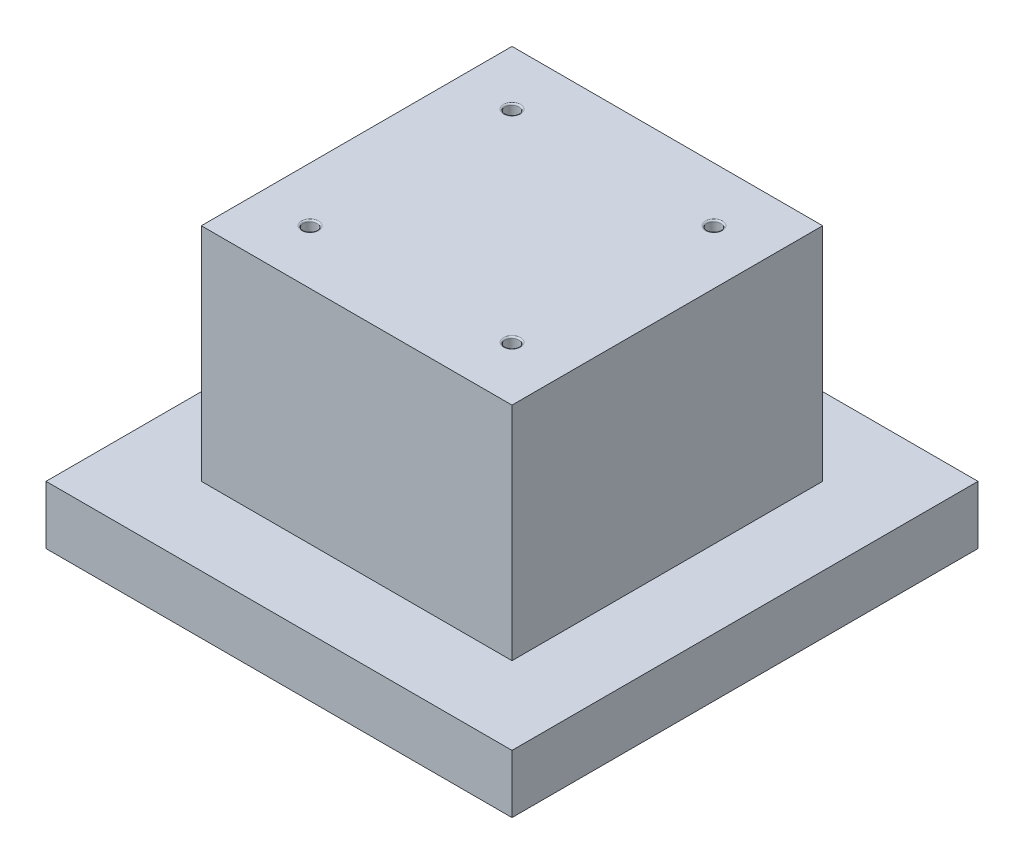
ISO-10303-21;
HEADER;
FILE_DESCRIPTION(('STEP AP214'),'2;1');
FILE_NAME('part.step','',(''),(''),'','','');
FILE_SCHEMA(('AUTOMOTIVE_DESIGN { 1 0 10303 214 1 1 1 1 }'));
ENDSEC;
DATA;
#1=APPLICATION_CONTEXT('core data for automotive mechanical design processes');
#2=APPLICATION_PROTOCOL_DEFINITION('international standard','automotive_design',2000,#1);
#3=PRODUCT_CONTEXT('',#1,'mechanical');
#4=PRODUCT('Part','Part','',(#3));
#5=PRODUCT_RELATED_PRODUCT_CATEGORY('part','',(#4));
#6=PRODUCT_DEFINITION_FORMATION('','',#4);
#7=PRODUCT_DEFINITION_CONTEXT('part definition',#1,'design');
#8=PRODUCT_DEFINITION('design','',#6,#7);
#9=PRODUCT_DEFINITION_SHAPE('','',#8);
#10=(LENGTH_UNIT() NAMED_UNIT(*) SI_UNIT(.MILLI.,.METRE.));
#11=(NAMED_UNIT(*) PLANE_ANGLE_UNIT() SI_UNIT($,.RADIAN.));
#12=(NAMED_UNIT(*) SI_UNIT($,.STERADIAN.) SOLID_ANGLE_UNIT());
#13=UNCERTAINTY_MEASURE_WITH_UNIT(LENGTH_MEASURE(1.E-05),#10,'distance_accuracy_value','');
#14=(GEOMETRIC_REPRESENTATION_CONTEXT(3) GLOBAL_UNCERTAINTY_ASSIGNED_CONTEXT((#13)) GLOBAL_UNIT_ASSIGNED_CONTEXT((#10,
#11,#12)) REPRESENTATION_CONTEXT('',''));
#15=CARTESIAN_POINT('',(0.,0.,0.));
#16=DIRECTION('',(0.,0.,1.));
#17=DIRECTION('',(1.,0.,0.));
#18=AXIS2_PLACEMENT_3D('',#15,#16,#17);
#19=CARTESIAN_POINT('',(38.1,9.525,38.1));
#20=DIRECTION('',(0.,1.,0.));
#21=DIRECTION('',(0.,0.,1.));
#22=AXIS2_PLACEMENT_3D('',#19,#20,#21);
#23=PLANE('',#22);
#24=DIRECTION('',(0.,0.,-1.));
#25=VECTOR('',#24,1.);
#26=CARTESIAN_POINT('',(38.1,9.525,-38.1));
#27=LINE('',#26,#25);
#28=CARTESIAN_POINT('',(38.1,9.525,38.1));
#29=VERTEX_POINT('',#28);
#30=CARTESIAN_POINT('',(38.1,9.525,-38.1));
#31=VERTEX_POINT('',#30);
#32=EDGE_CURVE('E220',#29,#31,#27,.T.);
#33=ORIENTED_EDGE('',*,*,#32,.T.);
#34=DIRECTION('',(-1.,0.,0.));
#35=VECTOR('',#34,1.);
#36=CARTESIAN_POINT('',(-38.1,9.525,-38.1));
#37=LINE('',#36,#35);
#38=CARTESIAN_POINT('',(-38.1,9.525,-38.1));
#39=VERTEX_POINT('',#38);
#40=EDGE_CURVE('E223',#31,#39,#37,.T.);
#41=ORIENTED_EDGE('',*,*,#40,.T.);
#42=DIRECTION('',(0.,0.,1.));
#43=VECTOR('',#42,1.);
#44=CARTESIAN_POINT('',(-38.1,9.525,-38.1));
#45=LINE('',#44,#43);
#46=CARTESIAN_POINT('',(-38.1,9.525,38.1));
#47=VERTEX_POINT('',#46);
#48=EDGE_CURVE('E226',#39,#47,#45,.T.);
#49=ORIENTED_EDGE('',*,*,#48,.T.);
#50=DIRECTION('',(1.,0.,0.));
#51=VECTOR('',#50,1.);
#52=CARTESIAN_POINT('',(-38.1,9.525,38.1));
#53=LINE('',#52,#51);
#54=EDGE_CURVE('E228',#47,#29,#53,.T.);
#55=ORIENTED_EDGE('',*,*,#54,.T.);
#56=EDGE_LOOP('',(#33,#41,#49,#55));
#57=FACE_BOUND('',#56,.T.);
#58=DIRECTION('',(-1.,0.,0.));
#59=VECTOR('',#58,1.);
#60=CARTESIAN_POINT('',(-25.4,9.525,-25.4));
#61=LINE('',#60,#59);
#62=CARTESIAN_POINT('',(25.4,9.525,-25.4));
#63=VERTEX_POINT('',#62);
#64=CARTESIAN_POINT('',(-25.4,9.525,-25.4));
#65=VERTEX_POINT('',#64);
#66=EDGE_CURVE('E176',#63,#65,#61,.T.);
#67=ORIENTED_EDGE('',*,*,#66,.F.);
#68=DIRECTION('',(0.,0.,-1.));
#69=VECTOR('',#68,1.);
#70=CARTESIAN_POINT('',(25.4,9.525,-25.4));
#71=LINE('',#70,#69);
#72=CARTESIAN_POINT('',(25.4,9.525,25.4));
#73=VERTEX_POINT('',#72);
#74=EDGE_CURVE('E162',#73,#63,#71,.T.);
#75=ORIENTED_EDGE('',*,*,#74,.F.);
#76=DIRECTION('',(1.,0.,0.));
#77=VECTOR('',#76,1.);
#78=CARTESIAN_POINT('',(-25.4,9.525,25.4));
#79=LINE('',#78,#77);
#80=CARTESIAN_POINT('',(-25.4,9.525,25.4));
#81=VERTEX_POINT('',#80);
#82=EDGE_CURVE('E167',#81,#73,#79,.T.);
#83=ORIENTED_EDGE('',*,*,#82,.F.);
#84=DIRECTION('',(0.,0.,1.));
#85=VECTOR('',#84,1.);
#86=CARTESIAN_POINT('',(-25.4,9.525,-25.4));
#87=LINE('',#86,#85);
#88=EDGE_CURVE('E178',#65,#81,#87,.T.);
#89=ORIENTED_EDGE('',*,*,#88,.F.);
#90=EDGE_LOOP('',(#67,#75,#83,#89));
#91=FACE_BOUND('',#90,.T.);
#92=ADVANCED_FACE('F41',(#57,#91),#23,.T.);
#93=CARTESIAN_POINT('',(38.1,9.525,-38.1));
#94=DIRECTION('',(-1.,0.,0.));
#95=DIRECTION('',(0.,0.,1.));
#96=AXIS2_PLACEMENT_3D('',#93,#94,#95);
#97=PLANE('',#96);
#98=DIRECTION('',(0.,0.,-1.));
#99=VECTOR('',#98,1.);
#100=CARTESIAN_POINT('',(38.1,0.,-38.1));
#101=LINE('',#100,#99);
#102=CARTESIAN_POINT('',(38.1,0.,38.1));
#103=VERTEX_POINT('',#102);
#104=CARTESIAN_POINT('',(38.1,0.,-38.1));
#105=VERTEX_POINT('',#104);
#106=EDGE_CURVE('E214',#103,#105,#101,.T.);
#107=ORIENTED_EDGE('',*,*,#106,.T.);
#108=DIRECTION('',(0.,-1.,0.));
#109=VECTOR('',#108,1.);
#110=CARTESIAN_POINT('',(38.1,9.525,-38.1));
#111=LINE('',#110,#109);
#112=EDGE_CURVE('E246',#31,#105,#111,.T.);
#113=ORIENTED_EDGE('',*,*,#112,.F.);
#114=ORIENTED_EDGE('',*,*,#32,.F.);
#115=DIRECTION('',(0.,-1.,0.));
#116=VECTOR('',#115,1.);
#117=CARTESIAN_POINT('',(38.1,9.525,38.1));
#118=LINE('',#117,#116);
#119=EDGE_CURVE('E230',#29,#103,#118,.T.);
#120=ORIENTED_EDGE('',*,*,#119,.T.);
#121=EDGE_LOOP('',(#107,#113,#114,#120));
#122=FACE_BOUND('',#121,.T.);
#123=ADVANCED_FACE('F284',(#122),#97,.F.);
#124=CARTESIAN_POINT('',(-38.1,9.525,-38.1));
#125=DIRECTION('',(0.,0.,1.));
#126=DIRECTION('',(1.,0.,0.));
#127=AXIS2_PLACEMENT_3D('',#124,#125,#126);
#128=PLANE('',#127);
#129=DIRECTION('',(-1.,0.,0.));
#130=VECTOR('',#129,1.);
#131=CARTESIAN_POINT('',(-38.1,0.,-38.1));
#132=LINE('',#131,#130);
#133=CARTESIAN_POINT('',(-38.1,0.,-38.1));
#134=VERTEX_POINT('',#133);
#135=EDGE_CURVE('E233',#105,#134,#132,.T.);
#136=ORIENTED_EDGE('',*,*,#135,.T.);
#137=DIRECTION('',(0.,-1.,0.));
#138=VECTOR('',#137,1.);
#139=CARTESIAN_POINT('',(-38.1,9.525,-38.1));
#140=LINE('',#139,#138);
#141=EDGE_CURVE('E243',#39,#134,#140,.T.);
#142=ORIENTED_EDGE('',*,*,#141,.F.);
#143=ORIENTED_EDGE('',*,*,#40,.F.);
#144=ORIENTED_EDGE('',*,*,#112,.T.);
#145=EDGE_LOOP('',(#136,#142,#143,#144));
#146=FACE_BOUND('',#145,.T.);
#147=ADVANCED_FACE('F290',(#146),#128,.F.);
#148=CARTESIAN_POINT('',(-38.1,9.525,-38.1));
#149=DIRECTION('',(1.,0.,0.));
#150=DIRECTION('',(0.,0.,-1.));
#151=AXIS2_PLACEMENT_3D('',#148,#149,#150);
#152=PLANE('',#151);
#153=DIRECTION('',(0.,0.,1.));
#154=VECTOR('',#153,1.);
#155=CARTESIAN_POINT('',(-38.1,0.,-38.1));
#156=LINE('',#155,#154);
#157=CARTESIAN_POINT('',(-38.1,0.,38.1));
#158=VERTEX_POINT('',#157);
#159=EDGE_CURVE('E235',#134,#158,#156,.T.);
#160=ORIENTED_EDGE('',*,*,#159,.T.);
#161=DIRECTION('',(0.,-1.,0.));
#162=VECTOR('',#161,1.);
#163=CARTESIAN_POINT('',(-38.1,9.525,38.1));
#164=LINE('',#163,#162);
#165=EDGE_CURVE('E240',#47,#158,#164,.T.);
#166=ORIENTED_EDGE('',*,*,#165,.F.);
#167=ORIENTED_EDGE('',*,*,#48,.F.);
#168=ORIENTED_EDGE('',*,*,#141,.T.);
#169=EDGE_LOOP('',(#160,#166,#167,#168));
#170=FACE_BOUND('',#169,.T.);
#171=ADVANCED_FACE('F305',(#170),#152,.F.);
#172=CARTESIAN_POINT('',(-38.1,9.525,38.1));
#173=DIRECTION('',(0.,0.,-1.));
#174=DIRECTION('',(-1.,0.,0.));
#175=AXIS2_PLACEMENT_3D('',#172,#173,#174);
#176=PLANE('',#175);
#177=DIRECTION('',(1.,0.,0.));
#178=VECTOR('',#177,1.);
#179=CARTESIAN_POINT('',(-38.1,0.,38.1));
#180=LINE('',#179,#178);
#181=EDGE_CURVE('E224',#158,#103,#180,.T.);
#182=ORIENTED_EDGE('',*,*,#181,.T.);
#183=ORIENTED_EDGE('',*,*,#119,.F.);
#184=ORIENTED_EDGE('',*,*,#54,.F.);
#185=ORIENTED_EDGE('',*,*,#165,.T.);
#186=EDGE_LOOP('',(#182,#183,#184,#185));
#187=FACE_BOUND('',#186,.T.);
#188=ADVANCED_FACE('F301',(#187),#176,.F.);
#189=CARTESIAN_POINT('',(38.1,0.,38.1));
#190=DIRECTION('',(0.,1.,0.));
#191=DIRECTION('',(0.,0.,1.));
#192=AXIS2_PLACEMENT_3D('',#189,#190,#191);
#193=PLANE('',#192);
#194=DIRECTION('',(-1.,0.,0.));
#195=VECTOR('',#194,1.);
#196=CARTESIAN_POINT('',(-34.29,0.,34.29));
#197=LINE('',#196,#195);
#198=CARTESIAN_POINT('',(34.29,0.,34.29));
#199=VERTEX_POINT('',#198);
#200=CARTESIAN_POINT('',(-34.29,0.,34.29));
#201=VERTEX_POINT('',#200);
#202=EDGE_CURVE('E204',#199,#201,#197,.T.);
#203=ORIENTED_EDGE('',*,*,#202,.F.);
#204=DIRECTION('',(0.,0.,1.));
#205=VECTOR('',#204,1.);
#206=CARTESIAN_POINT('',(34.29,0.,34.29));
#207=LINE('',#206,#205);
#208=CARTESIAN_POINT('',(34.29,0.,-34.29));
#209=VERTEX_POINT('',#208);
#210=EDGE_CURVE('E64',#209,#199,#207,.T.);
#211=ORIENTED_EDGE('',*,*,#210,.F.);
#212=DIRECTION('',(1.,0.,0.));
#213=VECTOR('',#212,1.);
#214=CARTESIAN_POINT('',(-34.29,0.,-34.29));
#215=LINE('',#214,#213);
#216=CARTESIAN_POINT('',(-34.29,0.,-34.29));
#217=VERTEX_POINT('',#216);
#218=EDGE_CURVE('E193',#217,#209,#215,.T.);
#219=ORIENTED_EDGE('',*,*,#218,.F.);
#220=DIRECTION('',(0.,0.,-1.));
#221=VECTOR('',#220,1.);
#222=CARTESIAN_POINT('',(-34.29,0.,34.29));
#223=LINE('',#222,#221);
#224=EDGE_CURVE('E207',#201,#217,#223,.T.);
#225=ORIENTED_EDGE('',*,*,#224,.F.);
#226=EDGE_LOOP('',(#203,#211,#219,#225));
#227=FACE_BOUND('',#226,.T.);
#228=ORIENTED_EDGE('',*,*,#106,.F.);
#229=ORIENTED_EDGE('',*,*,#181,.F.);
#230=ORIENTED_EDGE('',*,*,#159,.F.);
#231=ORIENTED_EDGE('',*,*,#135,.F.);
#232=EDGE_LOOP('',(#228,#229,#230,#231));
#233=FACE_BOUND('',#232,.T.);
#234=ADVANCED_FACE('F298',(#227,#233),#193,.F.);
#235=CARTESIAN_POINT('',(34.29,0.79375,34.29));
#236=DIRECTION('',(1.,0.,0.));
#237=DIRECTION('',(0.,0.,-1.));
#238=AXIS2_PLACEMENT_3D('',#235,#236,#237);
#239=PLANE('',#238);
#240=ORIENTED_EDGE('',*,*,#210,.T.);
#241=DIRECTION('',(0.,-1.,0.));
#242=VECTOR('',#241,1.);
#243=CARTESIAN_POINT('',(34.29,0.79375,34.29));
#244=LINE('',#243,#242);
#245=CARTESIAN_POINT('',(34.29,0.79375,34.29));
#246=VERTEX_POINT('',#245);
#247=EDGE_CURVE('E202',#246,#199,#244,.T.);
#248=ORIENTED_EDGE('',*,*,#247,.F.);
#249=DIRECTION('',(0.,0.,1.));
#250=VECTOR('',#249,1.);
#251=CARTESIAN_POINT('',(34.29,0.79375,34.29));
#252=LINE('',#251,#250);
#253=CARTESIAN_POINT('',(34.29,0.79375,-34.29));
#254=VERTEX_POINT('',#253);
#255=EDGE_CURVE('E189',#254,#246,#252,.T.);
#256=ORIENTED_EDGE('',*,*,#255,.F.);
#257=DIRECTION('',(0.,-1.,0.));
#258=VECTOR('',#257,1.);
#259=CARTESIAN_POINT('',(34.29,0.79375,-34.29));
#260=LINE('',#259,#258);
#261=EDGE_CURVE('E212',#254,#209,#260,.T.);
#262=ORIENTED_EDGE('',*,*,#261,.T.);
#263=EDGE_LOOP('',(#240,#248,#256,#262));
#264=FACE_BOUND('',#263,.T.);
#265=ADVANCED_FACE('F296',(#264),#239,.F.);
#266=CARTESIAN_POINT('',(-34.29,0.79375,-34.29));
#267=DIRECTION('',(0.,0.,-1.));
#268=DIRECTION('',(-1.,0.,0.));
#269=AXIS2_PLACEMENT_3D('',#266,#267,#268);
#270=PLANE('',#269);
#271=ORIENTED_EDGE('',*,*,#218,.T.);
#272=ORIENTED_EDGE('',*,*,#261,.F.);
#273=DIRECTION('',(1.,0.,0.));
#274=VECTOR('',#273,1.);
#275=CARTESIAN_POINT('',(-34.29,0.79375,-34.29));
#276=LINE('',#275,#274);
#277=CARTESIAN_POINT('',(-34.29,0.79375,-34.29));
#278=VERTEX_POINT('',#277);
#279=EDGE_CURVE('E199',#278,#254,#276,.T.);
#280=ORIENTED_EDGE('',*,*,#279,.F.);
#281=DIRECTION('',(0.,-1.,0.));
#282=VECTOR('',#281,1.);
#283=CARTESIAN_POINT('',(-34.29,0.79375,-34.29));
#284=LINE('',#283,#282);
#285=EDGE_CURVE('E215',#278,#217,#284,.T.);
#286=ORIENTED_EDGE('',*,*,#285,.T.);
#287=EDGE_LOOP('',(#271,#272,#280,#286));
#288=FACE_BOUND('',#287,.T.);
#289=ADVANCED_FACE('F370',(#288),#270,.F.);
#290=CARTESIAN_POINT('',(-34.29,0.79375,34.29));
#291=DIRECTION('',(-1.,0.,0.));
#292=DIRECTION('',(0.,0.,1.));
#293=AXIS2_PLACEMENT_3D('',#290,#291,#292);
#294=PLANE('',#293);
#295=ORIENTED_EDGE('',*,*,#224,.T.);
#296=ORIENTED_EDGE('',*,*,#285,.F.);
#297=DIRECTION('',(0.,0.,-1.));
#298=VECTOR('',#297,1.);
#299=CARTESIAN_POINT('',(-34.29,0.79375,34.29));
#300=LINE('',#299,#298);
#301=CARTESIAN_POINT('',(-34.29,0.79375,34.29));
#302=VERTEX_POINT('',#301);
#303=EDGE_CURVE('E196',#302,#278,#300,.T.);
#304=ORIENTED_EDGE('',*,*,#303,.F.);
#305=DIRECTION('',(0.,-1.,0.));
#306=VECTOR('',#305,1.);
#307=CARTESIAN_POINT('',(-34.29,0.79375,34.29));
#308=LINE('',#307,#306);
#309=EDGE_CURVE('E217',#302,#201,#308,.T.);
#310=ORIENTED_EDGE('',*,*,#309,.T.);
#311=EDGE_LOOP('',(#295,#296,#304,#310));
#312=FACE_BOUND('',#311,.T.);
#313=ADVANCED_FACE('F373',(#312),#294,.F.);
#314=CARTESIAN_POINT('',(-34.29,0.79375,34.29));
#315=DIRECTION('',(0.,0.,1.));
#316=DIRECTION('',(1.,0.,0.));
#317=AXIS2_PLACEMENT_3D('',#314,#315,#316);
#318=PLANE('',#317);
#319=ORIENTED_EDGE('',*,*,#202,.T.);
#320=ORIENTED_EDGE('',*,*,#309,.F.);
#321=DIRECTION('',(-1.,0.,0.));
#322=VECTOR('',#321,1.);
#323=CARTESIAN_POINT('',(-34.29,0.79375,34.29));
#324=LINE('',#323,#322);
#325=EDGE_CURVE('E192',#246,#302,#324,.T.);
#326=ORIENTED_EDGE('',*,*,#325,.F.);
#327=ORIENTED_EDGE('',*,*,#247,.T.);
#328=EDGE_LOOP('',(#319,#320,#326,#327));
#329=FACE_BOUND('',#328,.T.);
#330=ADVANCED_FACE('F368',(#329),#318,.F.);
#331=CARTESIAN_POINT('',(34.29,0.79375,-34.29));
#332=DIRECTION('',(0.,-1.,0.));
#333=DIRECTION('',(0.,0.,-1.));
#334=AXIS2_PLACEMENT_3D('',#331,#332,#333);
#335=PLANE('',#334);
#336=ORIENTED_EDGE('',*,*,#255,.T.);
#337=ORIENTED_EDGE('',*,*,#325,.T.);
#338=ORIENTED_EDGE('',*,*,#303,.T.);
#339=ORIENTED_EDGE('',*,*,#279,.T.);
#340=EDGE_LOOP('',(#336,#337,#338,#339));
#341=FACE_BOUND('',#340,.T.);
#342=ADVANCED_FACE('F364',(#341),#335,.T.);
#343=CARTESIAN_POINT('',(25.4,45.72,-25.4));
#344=DIRECTION('',(-1.,0.,0.));
#345=DIRECTION('',(0.,0.,1.));
#346=AXIS2_PLACEMENT_3D('',#343,#344,#345);
#347=PLANE('',#346);
#348=ORIENTED_EDGE('',*,*,#74,.T.);
#349=DIRECTION('',(0.,-1.,0.));
#350=VECTOR('',#349,1.);
#351=CARTESIAN_POINT('',(25.4,45.72,-25.4));
#352=LINE('',#351,#350);
#353=CARTESIAN_POINT('',(25.4,45.72,-25.4));
#354=VERTEX_POINT('',#353);
#355=EDGE_CURVE('E187',#354,#63,#352,.T.);
#356=ORIENTED_EDGE('',*,*,#355,.F.);
#357=DIRECTION('',(0.,0.,-1.));
#358=VECTOR('',#357,1.);
#359=CARTESIAN_POINT('',(25.4,45.72,-25.4));
#360=LINE('',#359,#358);
#361=CARTESIAN_POINT('',(25.4,45.72,25.4));
#362=VERTEX_POINT('',#361);
#363=EDGE_CURVE('E163',#362,#354,#360,.T.);
#364=ORIENTED_EDGE('',*,*,#363,.F.);
#365=DIRECTION('',(0.,-1.,0.));
#366=VECTOR('',#365,1.);
#367=CARTESIAN_POINT('',(25.4,45.72,25.4));
#368=LINE('',#367,#366);
#369=EDGE_CURVE('E173',#362,#73,#368,.T.);
#370=ORIENTED_EDGE('',*,*,#369,.T.);
#371=EDGE_LOOP('',(#348,#356,#364,#370));
#372=FACE_BOUND('',#371,.T.);
#373=ADVANCED_FACE('F360',(#372),#347,.F.);
#374=CARTESIAN_POINT('',(-25.4,45.72,-25.4));
#375=DIRECTION('',(0.,0.,1.));
#376=DIRECTION('',(1.,0.,0.));
#377=AXIS2_PLACEMENT_3D('',#374,#375,#376);
#378=PLANE('',#377);
#379=ORIENTED_EDGE('',*,*,#66,.T.);
#380=DIRECTION('',(0.,-1.,0.));
#381=VECTOR('',#380,1.);
#382=CARTESIAN_POINT('',(-25.4,45.72,-25.4));
#383=LINE('',#382,#381);
#384=CARTESIAN_POINT('',(-25.4,45.72,-25.4));
#385=VERTEX_POINT('',#384);
#386=EDGE_CURVE('E184',#385,#65,#383,.T.);
#387=ORIENTED_EDGE('',*,*,#386,.F.);
#388=DIRECTION('',(-1.,0.,0.));
#389=VECTOR('',#388,1.);
#390=CARTESIAN_POINT('',(-25.4,45.72,-25.4));
#391=LINE('',#390,#389);
#392=EDGE_CURVE('E166',#354,#385,#391,.T.);
#393=ORIENTED_EDGE('',*,*,#392,.F.);
#394=ORIENTED_EDGE('',*,*,#355,.T.);
#395=EDGE_LOOP('',(#379,#387,#393,#394));
#396=FACE_BOUND('',#395,.T.);
#397=ADVANCED_FACE('F356',(#396),#378,.F.);
#398=CARTESIAN_POINT('',(-25.4,45.72,-25.4));
#399=DIRECTION('',(1.,0.,0.));
#400=DIRECTION('',(0.,0.,-1.));
#401=AXIS2_PLACEMENT_3D('',#398,#399,#400);
#402=PLANE('',#401);
#403=ORIENTED_EDGE('',*,*,#88,.T.);
#404=DIRECTION('',(0.,-1.,0.));
#405=VECTOR('',#404,1.);
#406=CARTESIAN_POINT('',(-25.4,45.72,25.4));
#407=LINE('',#406,#405);
#408=CARTESIAN_POINT('',(-25.4,45.72,25.4));
#409=VERTEX_POINT('',#408);
#410=EDGE_CURVE('E56',#409,#81,#407,.T.);
#411=ORIENTED_EDGE('',*,*,#410,.F.);
#412=DIRECTION('',(0.,0.,1.));
#413=VECTOR('',#412,1.);
#414=CARTESIAN_POINT('',(-25.4,45.72,-25.4));
#415=LINE('',#414,#413);
#416=EDGE_CURVE('E169',#385,#409,#415,.T.);
#417=ORIENTED_EDGE('',*,*,#416,.F.);
#418=ORIENTED_EDGE('',*,*,#386,.T.);
#419=EDGE_LOOP('',(#403,#411,#417,#418));
#420=FACE_BOUND('',#419,.T.);
#421=ADVANCED_FACE('F353',(#420),#402,.F.);
#422=CARTESIAN_POINT('',(-25.4,45.72,25.4));
#423=DIRECTION('',(0.,0.,-1.));
#424=DIRECTION('',(-1.,0.,0.));
#425=AXIS2_PLACEMENT_3D('',#422,#423,#424);
#426=PLANE('',#425);
#427=ORIENTED_EDGE('',*,*,#82,.T.);
#428=ORIENTED_EDGE('',*,*,#369,.F.);
#429=DIRECTION('',(1.,0.,0.));
#430=VECTOR('',#429,1.);
#431=CARTESIAN_POINT('',(-25.4,45.72,25.4));
#432=LINE('',#431,#430);
#433=EDGE_CURVE('E171',#409,#362,#432,.T.);
#434=ORIENTED_EDGE('',*,*,#433,.F.);
#435=ORIENTED_EDGE('',*,*,#410,.T.);
#436=EDGE_LOOP('',(#427,#428,#434,#435));
#437=FACE_BOUND('',#436,.T.);
#438=ADVANCED_FACE('F349',(#437),#426,.F.);
#439=CARTESIAN_POINT('',(25.4,45.72,25.4));
#440=DIRECTION('',(0.,1.,0.));
#441=DIRECTION('',(0.,0.,1.));
#442=AXIS2_PLACEMENT_3D('',#439,#440,#441);
#443=PLANE('',#442);
#444=CARTESIAN_POINT('',(16.51,45.72,16.51));
#445=DIRECTION('',(0.,1.,0.));
#446=DIRECTION('',(0.,0.,1.));
#447=AXIS2_PLACEMENT_3D('',#444,#445,#446);
#448=CIRCLE('',#447,1.3843);
#449=CARTESIAN_POINT('',(16.51,45.72,17.8943));
#450=VERTEX_POINT('',#449);
#451=EDGE_CURVE('E261',#450,#450,#448,.F.);
#452=ORIENTED_EDGE('',*,*,#451,.T.);
#453=EDGE_LOOP('',(#452));
#454=FACE_BOUND('',#453,.T.);
#455=CARTESIAN_POINT('',(16.51,45.72,-16.51));
#456=DIRECTION('',(0.,1.,0.));
#457=DIRECTION('',(0.,0.,1.));
#458=AXIS2_PLACEMENT_3D('',#455,#456,#457);
#459=CIRCLE('',#458,1.3843);
#460=CARTESIAN_POINT('',(16.51,45.72,-15.1257));
#461=VERTEX_POINT('',#460);
#462=EDGE_CURVE('E258',#461,#461,#459,.F.);
#463=ORIENTED_EDGE('',*,*,#462,.T.);
#464=EDGE_LOOP('',(#463));
#465=FACE_BOUND('',#464,.T.);
#466=CARTESIAN_POINT('',(-16.51,45.72,-16.51));
#467=DIRECTION('',(0.,1.,0.));
#468=DIRECTION('',(0.,0.,1.));
#469=AXIS2_PLACEMENT_3D('',#466,#467,#468);
#470=CIRCLE('',#469,1.38429999999999);
#471=CARTESIAN_POINT('',(-16.51,45.72,-15.1257));
#472=VERTEX_POINT('',#471);
#473=EDGE_CURVE('E255',#472,#472,#470,.F.);
#474=ORIENTED_EDGE('',*,*,#473,.T.);
#475=EDGE_LOOP('',(#474));
#476=FACE_BOUND('',#475,.T.);
#477=CARTESIAN_POINT('',(-16.51,45.72,16.51));
#478=DIRECTION('',(0.,1.,0.));
#479=DIRECTION('',(0.,0.,1.));
#480=AXIS2_PLACEMENT_3D('',#477,#478,#479);
#481=CIRCLE('',#480,1.38429999999999);
#482=CARTESIAN_POINT('',(-16.51,45.72,17.8943));
#483=VERTEX_POINT('',#482);
#484=EDGE_CURVE('E252',#483,#483,#481,.F.);
#485=ORIENTED_EDGE('',*,*,#484,.T.);
#486=EDGE_LOOP('',(#485));
#487=FACE_BOUND('',#486,.T.);
#488=ORIENTED_EDGE('',*,*,#363,.T.);
#489=ORIENTED_EDGE('',*,*,#392,.T.);
#490=ORIENTED_EDGE('',*,*,#416,.T.);
#491=ORIENTED_EDGE('',*,*,#433,.T.);
#492=EDGE_LOOP('',(#488,#489,#490,#491));
#493=FACE_BOUND('',#492,.T.);
#494=ADVANCED_FACE('F345',(#454,#465,#476,#487,#493),#443,.T.);
#495=CARTESIAN_POINT('',(16.51,33.02,-16.51));
#496=DIRECTION('',(0.,1.,0.));
#497=DIRECTION('',(0.,0.,1.));
#498=AXIS2_PLACEMENT_3D('',#495,#496,#497);
#499=CONICAL_SURFACE('',#498,1.13029999999999,1.02974425867665);
#500=CARTESIAN_POINT('',(16.51,32.3408472423131,-16.51));
#501=VERTEX_POINT('',#500);
#502=VERTEX_LOOP('',#501);
#503=FACE_BOUND('',#502,.T.);
#504=CARTESIAN_POINT('',(16.51,33.02,-16.51));
#505=DIRECTION('',(0.,1.,0.));
#506=DIRECTION('',(0.,0.,1.));
#507=AXIS2_PLACEMENT_3D('',#504,#505,#506);
#508=CIRCLE('',#507,1.13029999999999);
#509=CARTESIAN_POINT('',(16.51,33.02,-15.3797));
#510=VERTEX_POINT('',#509);
#511=EDGE_CURVE('E159',#510,#510,#508,.T.);
#512=ORIENTED_EDGE('',*,*,#511,.T.);
#513=EDGE_LOOP('',(#512));
#514=FACE_BOUND('',#513,.T.);
#515=ADVANCED_FACE('F338',(#503,#514),#499,.F.);
#516=CARTESIAN_POINT('',(16.51,45.72,-16.51));
#517=DIRECTION('',(0.,1.,0.));
#518=DIRECTION('',(0.,0.,1.));
#519=AXIS2_PLACEMENT_3D('',#516,#517,#518);
#520=CYLINDRICAL_SURFACE('',#519,1.1303);
#521=CARTESIAN_POINT('',(16.51,45.466,-16.51));
#522=DIRECTION('',(0.,1.,0.));
#523=DIRECTION('',(0.,0.,1.));
#524=AXIS2_PLACEMENT_3D('',#521,#522,#523);
#525=CIRCLE('',#524,1.1303);
#526=CARTESIAN_POINT('',(16.51,45.466,-15.3797));
#527=VERTEX_POINT('',#526);
#528=EDGE_CURVE('E264',#527,#527,#525,.T.);
#529=ORIENTED_EDGE('',*,*,#528,.T.);
#530=EDGE_LOOP('',(#529));
#531=FACE_BOUND('',#530,.T.);
#532=ORIENTED_EDGE('',*,*,#511,.F.);
#533=EDGE_LOOP('',(#532));
#534=FACE_BOUND('',#533,.T.);
#535=ADVANCED_FACE('F332',(#531,#534),#520,.F.);
#536=CARTESIAN_POINT('',(16.51,33.02,16.51));
#537=DIRECTION('',(0.,1.,0.));
#538=DIRECTION('',(0.,0.,1.));
#539=AXIS2_PLACEMENT_3D('',#536,#537,#538);
#540=CONICAL_SURFACE('',#539,1.13029999999999,1.02974425867665);
#541=CARTESIAN_POINT('',(16.51,32.3408472423131,16.51));
#542=VERTEX_POINT('',#541);
#543=VERTEX_LOOP('',#542);
#544=FACE_BOUND('',#543,.T.);
#545=CARTESIAN_POINT('',(16.51,33.02,16.51));
#546=DIRECTION('',(0.,1.,0.));
#547=DIRECTION('',(0.,0.,1.));
#548=AXIS2_PLACEMENT_3D('',#545,#546,#547);
#549=CIRCLE('',#548,1.13029999999999);
#550=CARTESIAN_POINT('',(16.51,33.02,17.6403));
#551=VERTEX_POINT('',#550);
#552=EDGE_CURVE('E154',#551,#551,#549,.T.);
#553=ORIENTED_EDGE('',*,*,#552,.T.);
#554=EDGE_LOOP('',(#553));
#555=FACE_BOUND('',#554,.T.);
#556=ADVANCED_FACE('F327',(#544,#555),#540,.F.);
#557=CARTESIAN_POINT('',(16.51,45.72,16.51));
#558=DIRECTION('',(0.,1.,0.));
#559=DIRECTION('',(0.,0.,1.));
#560=AXIS2_PLACEMENT_3D('',#557,#558,#559);
#561=CYLINDRICAL_SURFACE('',#560,1.1303);
#562=CARTESIAN_POINT('',(16.51,45.466,16.51));
#563=DIRECTION('',(0.,1.,0.));
#564=DIRECTION('',(0.,0.,1.));
#565=AXIS2_PLACEMENT_3D('',#562,#563,#564);
#566=CIRCLE('',#565,1.1303);
#567=CARTESIAN_POINT('',(16.51,45.466,17.6403));
#568=VERTEX_POINT('',#567);
#569=EDGE_CURVE('E249',#568,#568,#566,.T.);
#570=ORIENTED_EDGE('',*,*,#569,.T.);
#571=EDGE_LOOP('',(#570));
#572=FACE_BOUND('',#571,.T.);
#573=ORIENTED_EDGE('',*,*,#552,.F.);
#574=EDGE_LOOP('',(#573));
#575=FACE_BOUND('',#574,.T.);
#576=ADVANCED_FACE('F323',(#572,#575),#561,.F.);
#577=CARTESIAN_POINT('',(-16.51,33.02,16.51));
#578=DIRECTION('',(0.,1.,0.));
#579=DIRECTION('',(0.,0.,1.));
#580=AXIS2_PLACEMENT_3D('',#577,#578,#579);
#581=CONICAL_SURFACE('',#580,1.13029999999999,1.02974425867665);
#582=CARTESIAN_POINT('',(-16.51,32.3408472423131,16.51));
#583=VERTEX_POINT('',#582);
#584=VERTEX_LOOP('',#583);
#585=FACE_BOUND('',#584,.T.);
#586=CARTESIAN_POINT('',(-16.51,33.02,16.51));
#587=DIRECTION('',(0.,1.,0.));
#588=DIRECTION('',(0.,0.,1.));
#589=AXIS2_PLACEMENT_3D('',#586,#587,#588);
#590=CIRCLE('',#589,1.13029999999999);
#591=CARTESIAN_POINT('',(-16.51,33.02,17.6403));
#592=VERTEX_POINT('',#591);
#593=EDGE_CURVE('E151',#592,#592,#590,.T.);
#594=ORIENTED_EDGE('',*,*,#593,.T.);
#595=EDGE_LOOP('',(#594));
#596=FACE_BOUND('',#595,.T.);
#597=ADVANCED_FACE('F326',(#585,#596),#581,.F.);
#598=CARTESIAN_POINT('',(-16.51,45.72,16.51));
#599=DIRECTION('',(0.,1.,0.));
#600=DIRECTION('',(0.,0.,1.));
#601=AXIS2_PLACEMENT_3D('',#598,#599,#600);
#602=CYLINDRICAL_SURFACE('',#601,1.13029999999999);
#603=CARTESIAN_POINT('',(-16.51,45.466,16.51));
#604=DIRECTION('',(0.,1.,0.));
#605=DIRECTION('',(0.,0.,1.));
#606=AXIS2_PLACEMENT_3D('',#603,#604,#605);
#607=CIRCLE('',#606,1.13029999999999);
#608=CARTESIAN_POINT('',(-16.51,45.466,17.6403));
#609=VERTEX_POINT('',#608);
#610=EDGE_CURVE('E11',#609,#609,#607,.T.);
#611=ORIENTED_EDGE('',*,*,#610,.T.);
#612=EDGE_LOOP('',(#611));
#613=FACE_BOUND('',#612,.T.);
#614=ORIENTED_EDGE('',*,*,#593,.F.);
#615=EDGE_LOOP('',(#614));
#616=FACE_BOUND('',#615,.T.);
#617=ADVANCED_FACE('F145',(#613,#616),#602,.F.);
#618=CARTESIAN_POINT('',(-16.51,33.02,-16.51));
#619=DIRECTION('',(0.,1.,0.));
#620=DIRECTION('',(0.,0.,1.));
#621=AXIS2_PLACEMENT_3D('',#618,#619,#620);
#622=CONICAL_SURFACE('',#621,1.13029999999999,1.02974425867665);
#623=CARTESIAN_POINT('',(-16.51,32.3408472423131,-16.51));
#624=VERTEX_POINT('',#623);
#625=VERTEX_LOOP('',#624);
#626=FACE_BOUND('',#625,.T.);
#627=CARTESIAN_POINT('',(-16.51,33.02,-16.51));
#628=DIRECTION('',(0.,1.,0.));
#629=DIRECTION('',(0.,0.,1.));
#630=AXIS2_PLACEMENT_3D('',#627,#628,#629);
#631=CIRCLE('',#630,1.13029999999999);
#632=CARTESIAN_POINT('',(-16.51,33.02,-15.3797));
#633=VERTEX_POINT('',#632);
#634=EDGE_CURVE('E149',#633,#633,#631,.T.);
#635=ORIENTED_EDGE('',*,*,#634,.T.);
#636=EDGE_LOOP('',(#635));
#637=FACE_BOUND('',#636,.T.);
#638=ADVANCED_FACE('F141',(#626,#637),#622,.F.);
#639=CARTESIAN_POINT('',(-16.51,45.72,-16.51));
#640=DIRECTION('',(0.,1.,0.));
#641=DIRECTION('',(0.,0.,1.));
#642=AXIS2_PLACEMENT_3D('',#639,#640,#641);
#643=CYLINDRICAL_SURFACE('',#642,1.13029999999999);
#644=CARTESIAN_POINT('',(-16.51,45.466,-16.51));
#645=DIRECTION('',(0.,1.,0.));
#646=DIRECTION('',(0.,0.,1.));
#647=AXIS2_PLACEMENT_3D('',#644,#645,#646);
#648=CIRCLE('',#647,1.13029999999999);
#649=CARTESIAN_POINT('',(-16.51,45.466,-15.3797));
#650=VERTEX_POINT('',#649);
#651=EDGE_CURVE('E49',#650,#650,#648,.T.);
#652=ORIENTED_EDGE('',*,*,#651,.T.);
#653=EDGE_LOOP('',(#652));
#654=FACE_BOUND('',#653,.T.);
#655=ORIENTED_EDGE('',*,*,#634,.F.);
#656=EDGE_LOOP('',(#655));
#657=FACE_BOUND('',#656,.T.);
#658=ADVANCED_FACE('F144',(#654,#657),#643,.F.);
#659=CARTESIAN_POINT('',(16.51,45.466,16.51));
#660=DIRECTION('',(0.,1.,0.));
#661=DIRECTION('',(0.,0.,1.));
#662=AXIS2_PLACEMENT_3D('',#659,#660,#661);
#663=TOROIDAL_SURFACE('',#662,1.3843,0.254);
#664=ORIENTED_EDGE('',*,*,#451,.F.);
#665=EDGE_LOOP('',(#664));
#666=FACE_BOUND('',#665,.T.);
#667=ORIENTED_EDGE('',*,*,#569,.F.);
#668=EDGE_LOOP('',(#667));
#669=FACE_BOUND('',#668,.T.);
#670=ADVANCED_FACE('F279',(#666,#669),#663,.T.);
#671=CARTESIAN_POINT('',(16.51,45.466,-16.51));
#672=DIRECTION('',(0.,1.,0.));
#673=DIRECTION('',(0.,0.,1.));
#674=AXIS2_PLACEMENT_3D('',#671,#672,#673);
#675=TOROIDAL_SURFACE('',#674,1.3843,0.254);
#676=ORIENTED_EDGE('',*,*,#462,.F.);
#677=EDGE_LOOP('',(#676));
#678=FACE_BOUND('',#677,.T.);
#679=ORIENTED_EDGE('',*,*,#528,.F.);
#680=EDGE_LOOP('',(#679));
#681=FACE_BOUND('',#680,.T.);
#682=ADVANCED_FACE('F272',(#678,#681),#675,.T.);
#683=CARTESIAN_POINT('',(-16.51,45.466,-16.51));
#684=DIRECTION('',(0.,1.,0.));
#685=DIRECTION('',(0.,0.,1.));
#686=AXIS2_PLACEMENT_3D('',#683,#684,#685);
#687=TOROIDAL_SURFACE('',#686,1.38429999999999,0.254);
#688=ORIENTED_EDGE('',*,*,#473,.F.);
#689=EDGE_LOOP('',(#688));
#690=FACE_BOUND('',#689,.T.);
#691=ORIENTED_EDGE('',*,*,#651,.F.);
#692=EDGE_LOOP('',(#691));
#693=FACE_BOUND('',#692,.T.);
#694=ADVANCED_FACE('F270',(#690,#693),#687,.T.);
#695=CARTESIAN_POINT('',(-16.51,45.466,16.51));
#696=DIRECTION('',(0.,1.,0.));
#697=DIRECTION('',(0.,0.,1.));
#698=AXIS2_PLACEMENT_3D('',#695,#696,#697);
#699=TOROIDAL_SURFACE('',#698,1.38429999999999,0.254);
#700=ORIENTED_EDGE('',*,*,#484,.F.);
#701=EDGE_LOOP('',(#700));
#702=FACE_BOUND('',#701,.T.);
#703=ORIENTED_EDGE('',*,*,#610,.F.);
#704=EDGE_LOOP('',(#703));
#705=FACE_BOUND('',#704,.T.);
#706=ADVANCED_FACE('F43',(#702,#705),#699,.T.);
#707=CLOSED_SHELL('',(#92,#123,#147,#171,#188,#234,#265,#289,#313,#330,#342,#373,#397,#421,#438,
#494,#515,#535,#556,#576,#597,#617,#638,#658,#670,#682,#694,#706));
#708=MANIFOLD_SOLID_BREP('B2',#707);
#709=ADVANCED_BREP_SHAPE_REPRESENTATION('',(#18,#708),#14);
#710=SHAPE_DEFINITION_REPRESENTATION(#9,#709);
ENDSEC;
END-ISO-10303-21;
